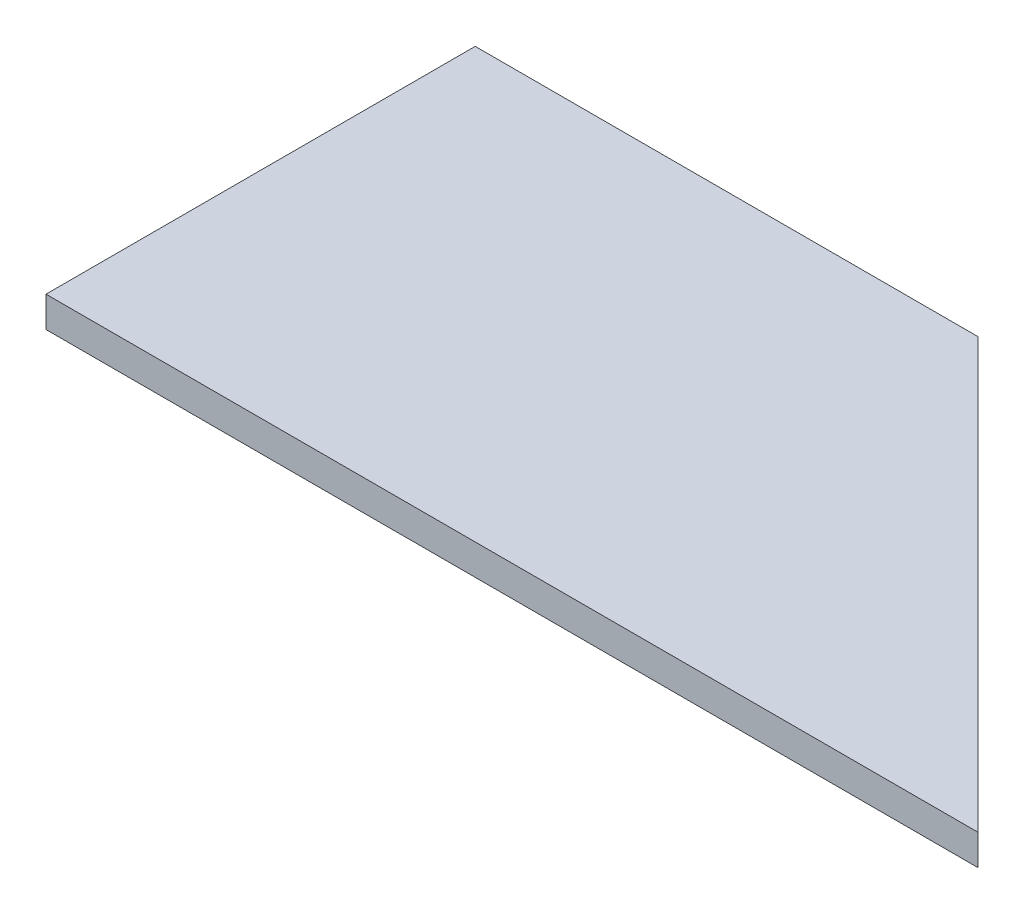
ISO-10303-21;
HEADER;
FILE_DESCRIPTION(('STEP AP214'),'2;1');
FILE_NAME('part.step','',(''),(''),'','','');
FILE_SCHEMA(('AUTOMOTIVE_DESIGN { 1 0 10303 214 1 1 1 1 }'));
ENDSEC;
DATA;
#1=APPLICATION_CONTEXT('core data for automotive mechanical design processes');
#2=APPLICATION_PROTOCOL_DEFINITION('international standard','automotive_design',2000,#1);
#3=PRODUCT_CONTEXT('',#1,'mechanical');
#4=PRODUCT('Part','Part','',(#3));
#5=PRODUCT_RELATED_PRODUCT_CATEGORY('part','',(#4));
#6=PRODUCT_DEFINITION_FORMATION('','',#4);
#7=PRODUCT_DEFINITION_CONTEXT('part definition',#1,'design');
#8=PRODUCT_DEFINITION('design','',#6,#7);
#9=PRODUCT_DEFINITION_SHAPE('','',#8);
#10=(LENGTH_UNIT() NAMED_UNIT(*) SI_UNIT(.MILLI.,.METRE.));
#11=(NAMED_UNIT(*) PLANE_ANGLE_UNIT() SI_UNIT($,.RADIAN.));
#12=(NAMED_UNIT(*) SI_UNIT($,.STERADIAN.) SOLID_ANGLE_UNIT());
#13=UNCERTAINTY_MEASURE_WITH_UNIT(LENGTH_MEASURE(1.E-05),#10,'distance_accuracy_value','');
#14=(GEOMETRIC_REPRESENTATION_CONTEXT(3) GLOBAL_UNCERTAINTY_ASSIGNED_CONTEXT((#13)) GLOBAL_UNIT_ASSIGNED_CONTEXT((#10,
#11,#12)) REPRESENTATION_CONTEXT('',''));
#15=CARTESIAN_POINT('',(0.,0.,0.));
#16=DIRECTION('',(0.,0.,1.));
#17=DIRECTION('',(1.,0.,0.));
#18=AXIS2_PLACEMENT_3D('',#15,#16,#17);
#19=CARTESIAN_POINT('',(-45.6,3.,21.));
#20=DIRECTION('',(0.,0.,-1.));
#21=DIRECTION('',(-1.,0.,0.));
#22=AXIS2_PLACEMENT_3D('',#19,#20,#21);
#23=PLANE('',#22);
#24=DIRECTION('',(1.,0.,0.));
#25=VECTOR('',#24,1.);
#26=CARTESIAN_POINT('',(-45.6,0.,21.));
#27=LINE('',#26,#25);
#28=CARTESIAN_POINT('',(-45.6,0.,21.));
#29=VERTEX_POINT('',#28);
#30=CARTESIAN_POINT('',(45.6,0.,21.));
#31=VERTEX_POINT('',#30);
#32=EDGE_CURVE('E96',#29,#31,#27,.T.);
#33=ORIENTED_EDGE('',*,*,#32,.T.);
#34=DIRECTION('',(0.,-1.,0.));
#35=VECTOR('',#34,1.);
#36=CARTESIAN_POINT('',(45.6,3.,21.));
#37=LINE('',#36,#35);
#38=CARTESIAN_POINT('',(45.6,3.,21.));
#39=VERTEX_POINT('',#38);
#40=EDGE_CURVE('E11',#39,#31,#37,.T.);
#41=ORIENTED_EDGE('',*,*,#40,.F.);
#42=DIRECTION('',(1.,0.,0.));
#43=VECTOR('',#42,1.);
#44=CARTESIAN_POINT('',(-45.6,3.,21.));
#45=LINE('',#44,#43);
#46=CARTESIAN_POINT('',(-45.6,3.,21.));
#47=VERTEX_POINT('',#46);
#48=EDGE_CURVE('E84',#47,#39,#45,.T.);
#49=ORIENTED_EDGE('',*,*,#48,.F.);
#50=DIRECTION('',(0.,-1.,0.));
#51=VECTOR('',#50,1.);
#52=CARTESIAN_POINT('',(-45.6,3.,21.));
#53=LINE('',#52,#51);
#54=EDGE_CURVE('E92',#47,#29,#53,.T.);
#55=ORIENTED_EDGE('',*,*,#54,.T.);
#56=EDGE_LOOP('',(#33,#41,#49,#55));
#57=FACE_BOUND('',#56,.T.);
#58=ADVANCED_FACE('F33',(#57),#23,.F.);
#59=CARTESIAN_POINT('',(45.6,3.,21.));
#60=DIRECTION('',(-0.707070707070707,0.,0.707142853462106));
#61=DIRECTION('',(0.707142853462107,0.,0.707070707070707));
#62=AXIS2_PLACEMENT_3D('',#59,#60,#61);
#63=PLANE('',#62);
#64=DIRECTION('',(-0.707142853462106,0.,-0.707070707070707));
#65=VECTOR('',#64,1.);
#66=CARTESIAN_POINT('',(45.6,0.,21.));
#67=LINE('',#66,#65);
#68=CARTESIAN_POINT('',(3.59571450435087,0.,-21.));
#69=VERTEX_POINT('',#68);
#70=EDGE_CURVE('E88',#31,#69,#67,.T.);
#71=ORIENTED_EDGE('',*,*,#70,.T.);
#72=DIRECTION('',(0.,-1.,0.));
#73=VECTOR('',#72,1.);
#74=CARTESIAN_POINT('',(3.59571450435087,3.,-21.));
#75=LINE('',#74,#73);
#76=CARTESIAN_POINT('',(3.59571450435087,3.,-21.));
#77=VERTEX_POINT('',#76);
#78=EDGE_CURVE('E41',#77,#69,#75,.T.);
#79=ORIENTED_EDGE('',*,*,#78,.F.);
#80=DIRECTION('',(-0.707142853462106,0.,-0.707070707070707));
#81=VECTOR('',#80,1.);
#82=CARTESIAN_POINT('',(45.6,3.,21.));
#83=LINE('',#82,#81);
#84=EDGE_CURVE('E79',#39,#77,#83,.T.);
#85=ORIENTED_EDGE('',*,*,#84,.F.);
#86=ORIENTED_EDGE('',*,*,#40,.T.);
#87=EDGE_LOOP('',(#71,#79,#85,#86));
#88=FACE_BOUND('',#87,.T.);
#89=ADVANCED_FACE('F87',(#88),#63,.F.);
#90=CARTESIAN_POINT('',(-45.6,3.,-21.));
#91=DIRECTION('',(0.,0.,1.));
#92=DIRECTION('',(1.,0.,0.));
#93=AXIS2_PLACEMENT_3D('',#90,#91,#92);
#94=PLANE('',#93);
#95=DIRECTION('',(-1.,0.,0.));
#96=VECTOR('',#95,1.);
#97=CARTESIAN_POINT('',(-45.6,0.,-21.));
#98=LINE('',#97,#96);
#99=CARTESIAN_POINT('',(-45.6,0.,-21.));
#100=VERTEX_POINT('',#99);
#101=EDGE_CURVE('E66',#69,#100,#98,.T.);
#102=ORIENTED_EDGE('',*,*,#101,.T.);
#103=DIRECTION('',(0.,-1.,0.));
#104=VECTOR('',#103,1.);
#105=CARTESIAN_POINT('',(-45.6,3.,-21.));
#106=LINE('',#105,#104);
#107=CARTESIAN_POINT('',(-45.6,3.,-21.));
#108=VERTEX_POINT('',#107);
#109=EDGE_CURVE('E89',#108,#100,#106,.T.);
#110=ORIENTED_EDGE('',*,*,#109,.F.);
#111=DIRECTION('',(-1.,0.,0.));
#112=VECTOR('',#111,1.);
#113=CARTESIAN_POINT('',(-45.6,3.,-21.));
#114=LINE('',#113,#112);
#115=EDGE_CURVE('E82',#77,#108,#114,.T.);
#116=ORIENTED_EDGE('',*,*,#115,.F.);
#117=ORIENTED_EDGE('',*,*,#78,.T.);
#118=EDGE_LOOP('',(#102,#110,#116,#117));
#119=FACE_BOUND('',#118,.T.);
#120=ADVANCED_FACE('F90',(#119),#94,.F.);
#121=CARTESIAN_POINT('',(-45.6,3.,-21.));
#122=DIRECTION('',(1.,0.,0.));
#123=DIRECTION('',(0.,0.,-1.));
#124=AXIS2_PLACEMENT_3D('',#121,#122,#123);
#125=PLANE('',#124);
#126=DIRECTION('',(0.,0.,1.));
#127=VECTOR('',#126,1.);
#128=CARTESIAN_POINT('',(-45.6,0.,-21.));
#129=LINE('',#128,#127);
#130=EDGE_CURVE('E72',#100,#29,#129,.T.);
#131=ORIENTED_EDGE('',*,*,#130,.T.);
#132=ORIENTED_EDGE('',*,*,#54,.F.);
#133=DIRECTION('',(0.,0.,1.));
#134=VECTOR('',#133,1.);
#135=CARTESIAN_POINT('',(-45.6,3.,-21.));
#136=LINE('',#135,#134);
#137=EDGE_CURVE('E49',#108,#47,#136,.T.);
#138=ORIENTED_EDGE('',*,*,#137,.F.);
#139=ORIENTED_EDGE('',*,*,#109,.T.);
#140=EDGE_LOOP('',(#131,#132,#138,#139));
#141=FACE_BOUND('',#140,.T.);
#142=ADVANCED_FACE('F103',(#141),#125,.F.);
#143=CARTESIAN_POINT('',(0.,3.,0.));
#144=DIRECTION('',(0.,-1.,0.));
#145=DIRECTION('',(0.,0.,-1.));
#146=AXIS2_PLACEMENT_3D('',#143,#144,#145);
#147=PLANE('',#146);
#148=ORIENTED_EDGE('',*,*,#48,.T.);
#149=ORIENTED_EDGE('',*,*,#84,.T.);
#150=ORIENTED_EDGE('',*,*,#115,.T.);
#151=ORIENTED_EDGE('',*,*,#137,.T.);
#152=EDGE_LOOP('',(#148,#149,#150,#151));
#153=FACE_BOUND('',#152,.T.);
#154=ADVANCED_FACE('F80',(#153),#147,.F.);
#155=CARTESIAN_POINT('',(0.,0.,0.));
#156=DIRECTION('',(0.,-1.,0.));
#157=DIRECTION('',(0.,0.,-1.));
#158=AXIS2_PLACEMENT_3D('',#155,#156,#157);
#159=PLANE('',#158);
#160=ORIENTED_EDGE('',*,*,#32,.F.);
#161=ORIENTED_EDGE('',*,*,#130,.F.);
#162=ORIENTED_EDGE('',*,*,#101,.F.);
#163=ORIENTED_EDGE('',*,*,#70,.F.);
#164=EDGE_LOOP('',(#160,#161,#162,#163));
#165=FACE_BOUND('',#164,.T.);
#166=ADVANCED_FACE('F106',(#165),#159,.T.);
#167=CLOSED_SHELL('',(#58,#89,#120,#142,#154,#166));
#168=MANIFOLD_SOLID_BREP('B2',#167);
#169=ADVANCED_BREP_SHAPE_REPRESENTATION('',(#18,#168),#14);
#170=SHAPE_DEFINITION_REPRESENTATION(#9,#169);
ENDSEC;
END-ISO-10303-21;
